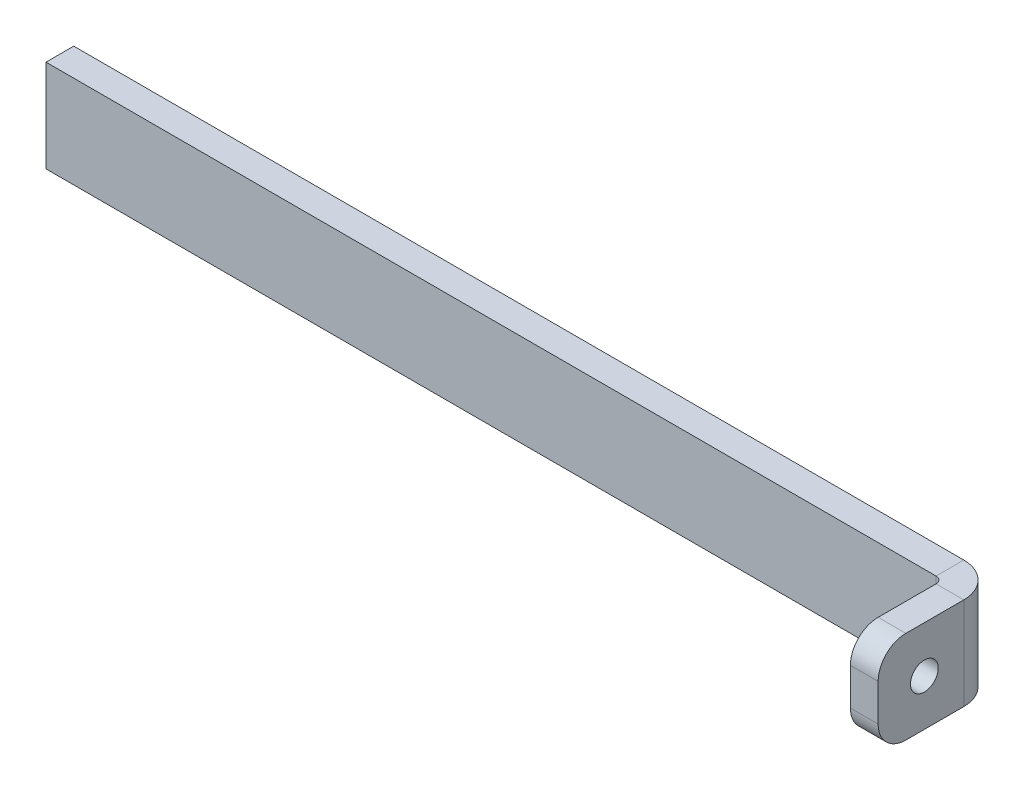
ISO-10303-21;
HEADER;
FILE_DESCRIPTION(('STEP AP214'),'2;1');
FILE_NAME('part.step','',(''),(''),'','','');
FILE_SCHEMA(('AUTOMOTIVE_DESIGN { 1 0 10303 214 1 1 1 1 }'));
ENDSEC;
DATA;
#1=APPLICATION_CONTEXT('core data for automotive mechanical design processes');
#2=APPLICATION_PROTOCOL_DEFINITION('international standard','automotive_design',2000,#1);
#3=PRODUCT_CONTEXT('',#1,'mechanical');
#4=PRODUCT('Part','Part','',(#3));
#5=PRODUCT_RELATED_PRODUCT_CATEGORY('part','',(#4));
#6=PRODUCT_DEFINITION_FORMATION('','',#4);
#7=PRODUCT_DEFINITION_CONTEXT('part definition',#1,'design');
#8=PRODUCT_DEFINITION('design','',#6,#7);
#9=PRODUCT_DEFINITION_SHAPE('','',#8);
#10=(LENGTH_UNIT() NAMED_UNIT(*) SI_UNIT(.MILLI.,.METRE.));
#11=(NAMED_UNIT(*) PLANE_ANGLE_UNIT() SI_UNIT($,.RADIAN.));
#12=(NAMED_UNIT(*) SI_UNIT($,.STERADIAN.) SOLID_ANGLE_UNIT());
#13=UNCERTAINTY_MEASURE_WITH_UNIT(LENGTH_MEASURE(1.E-05),#10,'distance_accuracy_value','');
#14=(GEOMETRIC_REPRESENTATION_CONTEXT(3) GLOBAL_UNCERTAINTY_ASSIGNED_CONTEXT((#13)) GLOBAL_UNIT_ASSIGNED_CONTEXT((#10,
#11,#12)) REPRESENTATION_CONTEXT('',''));
#15=CARTESIAN_POINT('',(0.,0.,0.));
#16=DIRECTION('',(0.,0.,1.));
#17=DIRECTION('',(1.,0.,0.));
#18=AXIS2_PLACEMENT_3D('',#15,#16,#17);
#19=CARTESIAN_POINT('',(-50.,5.,-3.));
#20=DIRECTION('',(0.,1.,0.));
#21=DIRECTION('',(0.,0.,1.));
#22=AXIS2_PLACEMENT_3D('',#19,#20,#21);
#23=PLANE('',#22);
#24=DIRECTION('',(-1.,0.,0.));
#25=VECTOR('',#24,1.);
#26=CARTESIAN_POINT('',(-50.,5.,0.));
#27=LINE('',#26,#25);
#28=CARTESIAN_POINT('',(46.2634,5.,0.));
#29=VERTEX_POINT('',#28);
#30=CARTESIAN_POINT('',(-50.,5.,0.));
#31=VERTEX_POINT('',#30);
#32=EDGE_CURVE('E195',#29,#31,#27,.T.);
#33=ORIENTED_EDGE('',*,*,#32,.F.);
#34=DIRECTION('',(0.,0.,-1.));
#35=VECTOR('',#34,1.);
#36=CARTESIAN_POINT('',(46.2634,5.,0.));
#37=LINE('',#36,#35);
#38=CARTESIAN_POINT('',(46.2634,5.,-3.));
#39=VERTEX_POINT('',#38);
#40=EDGE_CURVE('E185',#29,#39,#37,.T.);
#41=ORIENTED_EDGE('',*,*,#40,.T.);
#42=DIRECTION('',(-1.,0.,0.));
#43=VECTOR('',#42,1.);
#44=CARTESIAN_POINT('',(-50.,5.,-3.));
#45=LINE('',#44,#43);
#46=CARTESIAN_POINT('',(-50.,5.,-3.));
#47=VERTEX_POINT('',#46);
#48=EDGE_CURVE('E197',#39,#47,#45,.T.);
#49=ORIENTED_EDGE('',*,*,#48,.T.);
#50=DIRECTION('',(0.,0.,1.));
#51=VECTOR('',#50,1.);
#52=CARTESIAN_POINT('',(-50.,5.,-3.));
#53=LINE('',#52,#51);
#54=EDGE_CURVE('E206',#47,#31,#53,.T.);
#55=ORIENTED_EDGE('',*,*,#54,.T.);
#56=EDGE_LOOP('',(#33,#41,#49,#55));
#57=FACE_BOUND('',#56,.T.);
#58=ADVANCED_FACE('F58',(#57),#23,.T.);
#59=CARTESIAN_POINT('',(0.,0.,-3.));
#60=DIRECTION('',(0.,0.,-1.));
#61=DIRECTION('',(-1.,0.,0.));
#62=AXIS2_PLACEMENT_3D('',#59,#60,#61);
#63=PLANE('',#62);
#64=ORIENTED_EDGE('',*,*,#48,.F.);
#65=DIRECTION('',(0.,1.,0.));
#66=VECTOR('',#65,1.);
#67=CARTESIAN_POINT('',(46.2634,5.,-3.));
#68=LINE('',#67,#66);
#69=CARTESIAN_POINT('',(46.2634,-5.,-3.));
#70=VERTEX_POINT('',#69);
#71=EDGE_CURVE('E145',#39,#70,#68,.F.);
#72=ORIENTED_EDGE('',*,*,#71,.T.);
#73=DIRECTION('',(1.,0.,0.));
#74=VECTOR('',#73,1.);
#75=CARTESIAN_POINT('',(-50.,-5.,-3.));
#76=LINE('',#75,#74);
#77=CARTESIAN_POINT('',(-50.,-5.,-3.));
#78=VERTEX_POINT('',#77);
#79=EDGE_CURVE('E203',#78,#70,#76,.T.);
#80=ORIENTED_EDGE('',*,*,#79,.F.);
#81=DIRECTION('',(0.,-1.,0.));
#82=VECTOR('',#81,1.);
#83=CARTESIAN_POINT('',(-50.,-5.,-3.));
#84=LINE('',#83,#82);
#85=EDGE_CURVE('E199',#47,#78,#84,.T.);
#86=ORIENTED_EDGE('',*,*,#85,.F.);
#87=EDGE_LOOP('',(#64,#72,#80,#86));
#88=FACE_BOUND('',#87,.T.);
#89=ADVANCED_FACE('F265',(#88),#63,.T.);
#90=CARTESIAN_POINT('',(0.,0.,0.));
#91=DIRECTION('',(0.,0.,-1.));
#92=DIRECTION('',(-1.,0.,0.));
#93=AXIS2_PLACEMENT_3D('',#90,#91,#92);
#94=PLANE('',#93);
#95=DIRECTION('',(0.,1.,0.));
#96=VECTOR('',#95,1.);
#97=CARTESIAN_POINT('',(46.2634,5.,0.));
#98=LINE('',#97,#96);
#99=CARTESIAN_POINT('',(46.2634,-4.99999999999999,0.));
#100=VERTEX_POINT('',#99);
#101=EDGE_CURVE('E189',#29,#100,#98,.F.);
#102=ORIENTED_EDGE('',*,*,#101,.F.);
#103=ORIENTED_EDGE('',*,*,#32,.T.);
#104=DIRECTION('',(0.,-1.,0.));
#105=VECTOR('',#104,1.);
#106=CARTESIAN_POINT('',(-50.,-5.,0.));
#107=LINE('',#106,#105);
#108=CARTESIAN_POINT('',(-50.,-5.,0.));
#109=VERTEX_POINT('',#108);
#110=EDGE_CURVE('E208',#31,#109,#107,.T.);
#111=ORIENTED_EDGE('',*,*,#110,.T.);
#112=DIRECTION('',(1.,0.,0.));
#113=VECTOR('',#112,1.);
#114=CARTESIAN_POINT('',(-50.,-5.,0.));
#115=LINE('',#114,#113);
#116=EDGE_CURVE('E200',#109,#100,#115,.T.);
#117=ORIENTED_EDGE('',*,*,#116,.T.);
#118=EDGE_LOOP('',(#102,#103,#111,#117));
#119=FACE_BOUND('',#118,.T.);
#120=ADVANCED_FACE('F256',(#119),#94,.F.);
#121=CARTESIAN_POINT('',(-50.,-5.,-3.));
#122=DIRECTION('',(0.,-1.,0.));
#123=DIRECTION('',(0.,0.,-1.));
#124=AXIS2_PLACEMENT_3D('',#121,#122,#123);
#125=PLANE('',#124);
#126=DIRECTION('',(0.,0.,-1.));
#127=VECTOR('',#126,1.);
#128=CARTESIAN_POINT('',(46.2634,-4.99999999999999,0.));
#129=LINE('',#128,#127);
#130=EDGE_CURVE('E192',#100,#70,#129,.T.);
#131=ORIENTED_EDGE('',*,*,#130,.F.);
#132=ORIENTED_EDGE('',*,*,#116,.F.);
#133=DIRECTION('',(0.,0.,1.));
#134=VECTOR('',#133,1.);
#135=CARTESIAN_POINT('',(-50.,-5.,-3.));
#136=LINE('',#135,#134);
#137=EDGE_CURVE('E213',#78,#109,#136,.T.);
#138=ORIENTED_EDGE('',*,*,#137,.F.);
#139=ORIENTED_EDGE('',*,*,#79,.T.);
#140=EDGE_LOOP('',(#131,#132,#138,#139));
#141=FACE_BOUND('',#140,.T.);
#142=ADVANCED_FACE('F260',(#141),#125,.T.);
#143=CARTESIAN_POINT('',(-50.,-5.,-3.));
#144=DIRECTION('',(-1.,0.,0.));
#145=DIRECTION('',(0.,0.,1.));
#146=AXIS2_PLACEMENT_3D('',#143,#144,#145);
#147=PLANE('',#146);
#148=ORIENTED_EDGE('',*,*,#110,.F.);
#149=ORIENTED_EDGE('',*,*,#54,.F.);
#150=ORIENTED_EDGE('',*,*,#85,.T.);
#151=ORIENTED_EDGE('',*,*,#137,.T.);
#152=EDGE_LOOP('',(#148,#149,#150,#151));
#153=FACE_BOUND('',#152,.T.);
#154=ADVANCED_FACE('F269',(#153),#147,.T.);
#155=CARTESIAN_POINT('',(46.2634,-5.,0.7366));
#156=DIRECTION('',(0.,-1.,0.));
#157=DIRECTION('',(0.,0.,-1.));
#158=AXIS2_PLACEMENT_3D('',#155,#156,#157);
#159=PLANE('',#158);
#160=DIRECTION('',(-1.,0.,0.));
#161=VECTOR('',#160,1.);
#162=CARTESIAN_POINT('',(50.,-5.,0.736599999999986));
#163=LINE('',#162,#161);
#164=CARTESIAN_POINT('',(47.,-4.99999999999999,0.736599999999997));
#165=VERTEX_POINT('',#164);
#166=CARTESIAN_POINT('',(50.,-4.99999999999999,0.736599999999986));
#167=VERTEX_POINT('',#166);
#168=EDGE_CURVE('E179',#165,#167,#163,.F.);
#169=ORIENTED_EDGE('',*,*,#168,.F.);
#170=CARTESIAN_POINT('',(46.2634,-5.,0.7366));
#171=DIRECTION('',(0.,1.,0.));
#172=DIRECTION('',(0.,0.,1.));
#173=AXIS2_PLACEMENT_3D('',#170,#171,#172);
#174=CIRCLE('',#173,0.736599999999997);
#175=EDGE_CURVE('E148',#100,#165,#174,.F.);
#176=ORIENTED_EDGE('',*,*,#175,.F.);
#177=ORIENTED_EDGE('',*,*,#130,.T.);
#178=CARTESIAN_POINT('',(46.2634,-4.99999999999999,0.7366));
#179=DIRECTION('',(0.,1.,0.));
#180=DIRECTION('',(0.,0.,1.));
#181=AXIS2_PLACEMENT_3D('',#178,#179,#180);
#182=CIRCLE('',#181,3.7366);
#183=EDGE_CURVE('E184',#70,#167,#182,.F.);
#184=ORIENTED_EDGE('',*,*,#183,.T.);
#185=EDGE_LOOP('',(#169,#176,#177,#184));
#186=FACE_BOUND('',#185,.T.);
#187=ADVANCED_FACE('F252',(#186),#159,.T.);
#188=CARTESIAN_POINT('',(46.2634,5.,0.7366));
#189=DIRECTION('',(0.,-1.,0.));
#190=DIRECTION('',(0.,0.,-1.));
#191=AXIS2_PLACEMENT_3D('',#188,#189,#190);
#192=PLANE('',#191);
#193=CARTESIAN_POINT('',(46.2634,5.,0.7366));
#194=DIRECTION('',(0.,1.,0.));
#195=DIRECTION('',(0.,0.,1.));
#196=AXIS2_PLACEMENT_3D('',#193,#194,#195);
#197=CIRCLE('',#196,0.736599999999997);
#198=CARTESIAN_POINT('',(47.,5.,0.736599999999997));
#199=VERTEX_POINT('',#198);
#200=EDGE_CURVE('E155',#199,#29,#197,.T.);
#201=ORIENTED_EDGE('',*,*,#200,.F.);
#202=DIRECTION('',(-1.,0.,0.));
#203=VECTOR('',#202,1.);
#204=CARTESIAN_POINT('',(47.,5.,0.736599999999997));
#205=LINE('',#204,#203);
#206=CARTESIAN_POINT('',(50.,5.,0.736599999999986));
#207=VERTEX_POINT('',#206);
#208=EDGE_CURVE('E152',#199,#207,#205,.F.);
#209=ORIENTED_EDGE('',*,*,#208,.T.);
#210=CARTESIAN_POINT('',(46.2634,5.,0.7366));
#211=DIRECTION('',(0.,1.,0.));
#212=DIRECTION('',(0.,0.,1.));
#213=AXIS2_PLACEMENT_3D('',#210,#211,#212);
#214=CIRCLE('',#213,3.7366);
#215=EDGE_CURVE('E138',#207,#39,#214,.T.);
#216=ORIENTED_EDGE('',*,*,#215,.T.);
#217=ORIENTED_EDGE('',*,*,#40,.F.);
#218=EDGE_LOOP('',(#201,#209,#216,#217));
#219=FACE_BOUND('',#218,.T.);
#220=ADVANCED_FACE('F153',(#219),#192,.F.);
#221=CARTESIAN_POINT('',(46.2634,5.,0.7366));
#222=DIRECTION('',(0.,1.,0.));
#223=DIRECTION('',(1.,0.,0.));
#224=AXIS2_PLACEMENT_3D('',#221,#222,#223);
#225=CYLINDRICAL_SURFACE('',#224,3.7366);
#226=ORIENTED_EDGE('',*,*,#71,.F.);
#227=ORIENTED_EDGE('',*,*,#215,.F.);
#228=DIRECTION('',(0.,1.,0.));
#229=VECTOR('',#228,1.);
#230=CARTESIAN_POINT('',(50.,-5.,0.736599999999986));
#231=LINE('',#230,#229);
#232=EDGE_CURVE('E142',#207,#167,#231,.F.);
#233=ORIENTED_EDGE('',*,*,#232,.T.);
#234=ORIENTED_EDGE('',*,*,#183,.F.);
#235=EDGE_LOOP('',(#226,#227,#233,#234));
#236=FACE_BOUND('',#235,.T.);
#237=ADVANCED_FACE('F140',(#236),#225,.T.);
#238=CARTESIAN_POINT('',(46.2634,5.,0.7366));
#239=DIRECTION('',(0.,1.,0.));
#240=DIRECTION('',(1.,0.,0.));
#241=AXIS2_PLACEMENT_3D('',#238,#239,#240);
#242=CYLINDRICAL_SURFACE('',#241,0.736599999999997);
#243=ORIENTED_EDGE('',*,*,#101,.T.);
#244=ORIENTED_EDGE('',*,*,#175,.T.);
#245=DIRECTION('',(0.,1.,0.));
#246=VECTOR('',#245,1.);
#247=CARTESIAN_POINT('',(47.,-5.,0.736599999999997));
#248=LINE('',#247,#246);
#249=EDGE_CURVE('E157',#165,#199,#248,.T.);
#250=ORIENTED_EDGE('',*,*,#249,.T.);
#251=ORIENTED_EDGE('',*,*,#200,.T.);
#252=EDGE_LOOP('',(#243,#244,#250,#251));
#253=FACE_BOUND('',#252,.T.);
#254=ADVANCED_FACE('F248',(#253),#242,.F.);
#255=CARTESIAN_POINT('',(50.,-5.,0.));
#256=DIRECTION('',(0.,1.,0.));
#257=DIRECTION('',(0.,0.,1.));
#258=AXIS2_PLACEMENT_3D('',#255,#256,#257);
#259=PLANE('',#258);
#260=DIRECTION('',(0.,0.,-1.));
#261=VECTOR('',#260,1.);
#262=CARTESIAN_POINT('',(50.,-5.,-1.8394679161421E-13));
#263=LINE('',#262,#261);
#264=CARTESIAN_POINT('',(50.,-5.,6.99999999999999));
#265=VERTEX_POINT('',#264);
#266=EDGE_CURVE('E162',#265,#167,#263,.T.);
#267=ORIENTED_EDGE('',*,*,#266,.F.);
#268=DIRECTION('',(-1.,0.,0.));
#269=VECTOR('',#268,1.);
#270=CARTESIAN_POINT('',(50.,-5.,6.99999999999999));
#271=LINE('',#270,#269);
#272=CARTESIAN_POINT('',(47.,-5.,7.));
#273=VERTEX_POINT('',#272);
#274=EDGE_CURVE('E13',#265,#273,#271,.T.);
#275=ORIENTED_EDGE('',*,*,#274,.T.);
#276=DIRECTION('',(0.,0.,1.));
#277=VECTOR('',#276,1.);
#278=CARTESIAN_POINT('',(47.,-5.,0.));
#279=LINE('',#278,#277);
#280=EDGE_CURVE('E163',#273,#165,#279,.F.);
#281=ORIENTED_EDGE('',*,*,#280,.T.);
#282=ORIENTED_EDGE('',*,*,#168,.T.);
#283=EDGE_LOOP('',(#267,#275,#281,#282));
#284=FACE_BOUND('',#283,.T.);
#285=ADVANCED_FACE('F245',(#284),#259,.F.);
#286=CARTESIAN_POINT('',(50.,5.,9.99999999999999));
#287=DIRECTION('',(0.,-1.,0.));
#288=DIRECTION('',(0.,0.,-1.));
#289=AXIS2_PLACEMENT_3D('',#286,#287,#288);
#290=PLANE('',#289);
#291=DIRECTION('',(0.,0.,-1.));
#292=VECTOR('',#291,1.);
#293=CARTESIAN_POINT('',(47.,5.,10.));
#294=LINE('',#293,#292);
#295=CARTESIAN_POINT('',(47.,5.,7.));
#296=VERTEX_POINT('',#295);
#297=EDGE_CURVE('E175',#199,#296,#294,.F.);
#298=ORIENTED_EDGE('',*,*,#297,.T.);
#299=DIRECTION('',(-1.,0.,0.));
#300=VECTOR('',#299,1.);
#301=CARTESIAN_POINT('',(50.,5.,6.99999999999999));
#302=LINE('',#301,#300);
#303=CARTESIAN_POINT('',(50.,5.,6.99999999999999));
#304=VERTEX_POINT('',#303);
#305=EDGE_CURVE('E81',#296,#304,#302,.F.);
#306=ORIENTED_EDGE('',*,*,#305,.T.);
#307=DIRECTION('',(0.,0.,1.));
#308=VECTOR('',#307,1.);
#309=CARTESIAN_POINT('',(50.,5.,-1.8394679161421E-13));
#310=LINE('',#309,#308);
#311=EDGE_CURVE('E160',#207,#304,#310,.T.);
#312=ORIENTED_EDGE('',*,*,#311,.F.);
#313=ORIENTED_EDGE('',*,*,#208,.F.);
#314=EDGE_LOOP('',(#298,#306,#312,#313));
#315=FACE_BOUND('',#314,.T.);
#316=ADVANCED_FACE('F165',(#315),#290,.F.);
#317=CARTESIAN_POINT('',(50.,0.,-1.8394679161421E-13));
#318=DIRECTION('',(-1.,0.,0.));
#319=DIRECTION('',(0.,0.,1.));
#320=AXIS2_PLACEMENT_3D('',#317,#318,#319);
#321=PLANE('',#320);
#322=CARTESIAN_POINT('',(50.,0.,4.99999999999999));
#323=DIRECTION('',(1.,0.,0.));
#324=DIRECTION('',(0.,0.,-1.));
#325=AXIS2_PLACEMENT_3D('',#322,#323,#324);
#326=CIRCLE('',#325,1.5);
#327=CARTESIAN_POINT('',(50.,0.,3.49999999999999));
#328=VERTEX_POINT('',#327);
#329=EDGE_CURVE('E220',#328,#328,#326,.T.);
#330=ORIENTED_EDGE('',*,*,#329,.F.);
#331=EDGE_LOOP('',(#330));
#332=FACE_BOUND('',#331,.T.);
#333=ORIENTED_EDGE('',*,*,#311,.T.);
#334=CARTESIAN_POINT('',(50.,2.,6.99999999999999));
#335=DIRECTION('',(-1.,0.,0.));
#336=DIRECTION('',(0.,0.,1.));
#337=AXIS2_PLACEMENT_3D('',#334,#335,#336);
#338=CIRCLE('',#337,3.);
#339=CARTESIAN_POINT('',(50.,2.,9.99999999999999));
#340=VERTEX_POINT('',#339);
#341=EDGE_CURVE('E66',#304,#340,#338,.F.);
#342=ORIENTED_EDGE('',*,*,#341,.T.);
#343=DIRECTION('',(0.,-1.,0.));
#344=VECTOR('',#343,1.);
#345=CARTESIAN_POINT('',(50.,0.,9.99999999999999));
#346=LINE('',#345,#344);
#347=CARTESIAN_POINT('',(50.,-2.,9.99999999999999));
#348=VERTEX_POINT('',#347);
#349=EDGE_CURVE('E166',#340,#348,#346,.T.);
#350=ORIENTED_EDGE('',*,*,#349,.T.);
#351=CARTESIAN_POINT('',(50.,-2.,6.99999999999999));
#352=DIRECTION('',(-1.,0.,0.));
#353=DIRECTION('',(0.,0.,1.));
#354=AXIS2_PLACEMENT_3D('',#351,#352,#353);
#355=CIRCLE('',#354,3.);
#356=EDGE_CURVE('E73',#348,#265,#355,.F.);
#357=ORIENTED_EDGE('',*,*,#356,.T.);
#358=ORIENTED_EDGE('',*,*,#266,.T.);
#359=ORIENTED_EDGE('',*,*,#232,.F.);
#360=EDGE_LOOP('',(#333,#342,#350,#357,#358,#359));
#361=FACE_BOUND('',#360,.T.);
#362=ADVANCED_FACE('F159',(#332,#361),#321,.F.);
#363=CARTESIAN_POINT('',(47.,0.,-1.73472347597681E-13));
#364=DIRECTION('',(-1.,0.,0.));
#365=DIRECTION('',(0.,0.,1.));
#366=AXIS2_PLACEMENT_3D('',#363,#364,#365);
#367=PLANE('',#366);
#368=CARTESIAN_POINT('',(47.,0.,5.));
#369=DIRECTION('',(-1.,0.,0.));
#370=DIRECTION('',(0.,0.,1.));
#371=AXIS2_PLACEMENT_3D('',#368,#369,#370);
#372=CIRCLE('',#371,1.5);
#373=CARTESIAN_POINT('',(47.,0.,6.5));
#374=VERTEX_POINT('',#373);
#375=EDGE_CURVE('E182',#374,#374,#372,.T.);
#376=ORIENTED_EDGE('',*,*,#375,.F.);
#377=EDGE_LOOP('',(#376));
#378=FACE_BOUND('',#377,.T.);
#379=DIRECTION('',(0.,1.,0.));
#380=VECTOR('',#379,1.);
#381=CARTESIAN_POINT('',(47.,-5.,10.));
#382=LINE('',#381,#380);
#383=CARTESIAN_POINT('',(47.,2.,10.));
#384=VERTEX_POINT('',#383);
#385=CARTESIAN_POINT('',(47.,-2.,10.));
#386=VERTEX_POINT('',#385);
#387=EDGE_CURVE('E169',#384,#386,#382,.F.);
#388=ORIENTED_EDGE('',*,*,#387,.F.);
#389=CARTESIAN_POINT('',(47.,2.,7.));
#390=DIRECTION('',(-1.,0.,0.));
#391=DIRECTION('',(0.,0.,1.));
#392=AXIS2_PLACEMENT_3D('',#389,#390,#391);
#393=CIRCLE('',#392,3.);
#394=EDGE_CURVE('E227',#384,#296,#393,.T.);
#395=ORIENTED_EDGE('',*,*,#394,.T.);
#396=ORIENTED_EDGE('',*,*,#297,.F.);
#397=ORIENTED_EDGE('',*,*,#249,.F.);
#398=ORIENTED_EDGE('',*,*,#280,.F.);
#399=CARTESIAN_POINT('',(47.,-2.,7.));
#400=DIRECTION('',(-1.,0.,0.));
#401=DIRECTION('',(0.,0.,1.));
#402=AXIS2_PLACEMENT_3D('',#399,#400,#401);
#403=CIRCLE('',#402,3.);
#404=EDGE_CURVE('E225',#273,#386,#403,.T.);
#405=ORIENTED_EDGE('',*,*,#404,.T.);
#406=EDGE_LOOP('',(#388,#395,#396,#397,#398,#405));
#407=FACE_BOUND('',#406,.T.);
#408=ADVANCED_FACE('F239',(#378,#407),#367,.T.);
#409=CARTESIAN_POINT('',(50.,-5.,9.99999999999999));
#410=DIRECTION('',(0.,0.,-1.));
#411=DIRECTION('',(-1.,0.,0.));
#412=AXIS2_PLACEMENT_3D('',#409,#410,#411);
#413=PLANE('',#412);
#414=ORIENTED_EDGE('',*,*,#349,.F.);
#415=DIRECTION('',(-1.,0.,0.));
#416=VECTOR('',#415,1.);
#417=CARTESIAN_POINT('',(50.,2.,9.99999999999999));
#418=LINE('',#417,#416);
#419=EDGE_CURVE('E222',#340,#384,#418,.T.);
#420=ORIENTED_EDGE('',*,*,#419,.T.);
#421=ORIENTED_EDGE('',*,*,#387,.T.);
#422=DIRECTION('',(-1.,0.,0.));
#423=VECTOR('',#422,1.);
#424=CARTESIAN_POINT('',(50.,-2.,9.99999999999999));
#425=LINE('',#424,#423);
#426=EDGE_CURVE('E215',#386,#348,#425,.F.);
#427=ORIENTED_EDGE('',*,*,#426,.T.);
#428=EDGE_LOOP('',(#414,#420,#421,#427));
#429=FACE_BOUND('',#428,.T.);
#430=ADVANCED_FACE('F234',(#429),#413,.F.);
#431=CARTESIAN_POINT('',(40.,0.,5.00000000000002));
#432=DIRECTION('',(1.,0.,0.));
#433=DIRECTION('',(0.,0.,-1.));
#434=AXIS2_PLACEMENT_3D('',#431,#432,#433);
#435=CYLINDRICAL_SURFACE('',#434,1.5);
#436=ORIENTED_EDGE('',*,*,#375,.T.);
#437=EDGE_LOOP('',(#436));
#438=FACE_BOUND('',#437,.T.);
#439=ORIENTED_EDGE('',*,*,#329,.T.);
#440=EDGE_LOOP('',(#439));
#441=FACE_BOUND('',#440,.T.);
#442=ADVANCED_FACE('F285',(#438,#441),#435,.F.);
#443=CARTESIAN_POINT('',(50.,2.,6.99999999999999));
#444=DIRECTION('',(-1.,0.,0.));
#445=DIRECTION('',(0.,0.,1.));
#446=AXIS2_PLACEMENT_3D('',#443,#444,#445);
#447=CYLINDRICAL_SURFACE('',#446,3.);
#448=ORIENTED_EDGE('',*,*,#341,.F.);
#449=ORIENTED_EDGE('',*,*,#305,.F.);
#450=ORIENTED_EDGE('',*,*,#394,.F.);
#451=ORIENTED_EDGE('',*,*,#419,.F.);
#452=EDGE_LOOP('',(#448,#449,#450,#451));
#453=FACE_BOUND('',#452,.T.);
#454=ADVANCED_FACE('F237',(#453),#447,.T.);
#455=CARTESIAN_POINT('',(50.,-2.,6.99999999999999));
#456=DIRECTION('',(-1.,0.,0.));
#457=DIRECTION('',(0.,0.,1.));
#458=AXIS2_PLACEMENT_3D('',#455,#456,#457);
#459=CYLINDRICAL_SURFACE('',#458,3.);
#460=ORIENTED_EDGE('',*,*,#356,.F.);
#461=ORIENTED_EDGE('',*,*,#426,.F.);
#462=ORIENTED_EDGE('',*,*,#404,.F.);
#463=ORIENTED_EDGE('',*,*,#274,.F.);
#464=EDGE_LOOP('',(#460,#461,#462,#463));
#465=FACE_BOUND('',#464,.T.);
#466=ADVANCED_FACE('F60',(#465),#459,.T.);
#467=CLOSED_SHELL('',(#58,#89,#120,#142,#154,#187,#220,#237,#254,#285,#316,#362,#408,#430,#442,
#454,#466));
#468=MANIFOLD_SOLID_BREP('B2',#467);
#469=ADVANCED_BREP_SHAPE_REPRESENTATION('',(#18,#468),#14);
#470=SHAPE_DEFINITION_REPRESENTATION(#9,#469);
ENDSEC;
END-ISO-10303-21;
